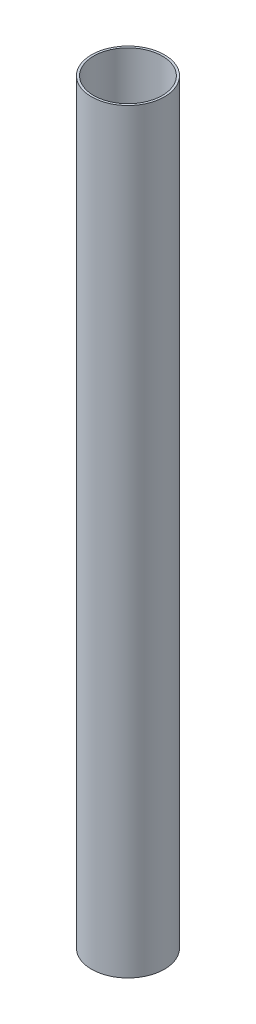
ISO-10303-21;
HEADER;
FILE_DESCRIPTION(('STEP AP214'),'2;1');
FILE_NAME('part.step','',(''),(''),'','','');
FILE_SCHEMA(('AUTOMOTIVE_DESIGN { 1 0 10303 214 1 1 1 1 }'));
ENDSEC;
DATA;
#1=APPLICATION_CONTEXT('core data for automotive mechanical design processes');
#2=APPLICATION_PROTOCOL_DEFINITION('international standard','automotive_design',2000,#1);
#3=PRODUCT_CONTEXT('',#1,'mechanical');
#4=PRODUCT('Part','Part','',(#3));
#5=PRODUCT_RELATED_PRODUCT_CATEGORY('part','',(#4));
#6=PRODUCT_DEFINITION_FORMATION('','',#4);
#7=PRODUCT_DEFINITION_CONTEXT('part definition',#1,'design');
#8=PRODUCT_DEFINITION('design','',#6,#7);
#9=PRODUCT_DEFINITION_SHAPE('','',#8);
#10=(LENGTH_UNIT() NAMED_UNIT(*) SI_UNIT(.MILLI.,.METRE.));
#11=(NAMED_UNIT(*) PLANE_ANGLE_UNIT() SI_UNIT($,.RADIAN.));
#12=(NAMED_UNIT(*) SI_UNIT($,.STERADIAN.) SOLID_ANGLE_UNIT());
#13=UNCERTAINTY_MEASURE_WITH_UNIT(LENGTH_MEASURE(1.E-05),#10,'distance_accuracy_value','');
#14=(GEOMETRIC_REPRESENTATION_CONTEXT(3) GLOBAL_UNCERTAINTY_ASSIGNED_CONTEXT((#13)) GLOBAL_UNIT_ASSIGNED_CONTEXT((#10,
#11,#12)) REPRESENTATION_CONTEXT('',''));
#15=CARTESIAN_POINT('',(0.,0.,0.));
#16=DIRECTION('',(0.,0.,1.));
#17=DIRECTION('',(1.,0.,0.));
#18=AXIS2_PLACEMENT_3D('',#15,#16,#17);
#19=CARTESIAN_POINT('',(0.,1146.81,0.));
#20=DIRECTION('',(0.,1.,0.));
#21=DIRECTION('',(0.,0.,1.));
#22=AXIS2_PLACEMENT_3D('',#19,#20,#21);
#23=CYLINDRICAL_SURFACE('',#22,49.5299999999999);
#24=CARTESIAN_POINT('',(0.,0.,0.));
#25=DIRECTION('',(0.,1.,0.));
#26=DIRECTION('',(0.,0.,1.));
#27=AXIS2_PLACEMENT_3D('',#24,#25,#26);
#28=CIRCLE('',#27,49.53);
#29=CARTESIAN_POINT('',(0.,0.,49.53));
#30=VERTEX_POINT('',#29);
#31=EDGE_CURVE('E10',#30,#30,#28,.T.);
#32=ORIENTED_EDGE('',*,*,#31,.F.);
#33=EDGE_LOOP('',(#32));
#34=FACE_BOUND('',#33,.T.);
#35=CARTESIAN_POINT('',(0.,1092.2,0.));
#36=DIRECTION('',(0.,1.,0.));
#37=DIRECTION('',(0.,0.,1.));
#38=AXIS2_PLACEMENT_3D('',#35,#36,#37);
#39=CIRCLE('',#38,49.5299999999999);
#40=CARTESIAN_POINT('',(0.,1092.2,49.5299999999999));
#41=VERTEX_POINT('',#40);
#42=EDGE_CURVE('E50',#41,#41,#39,.T.);
#43=ORIENTED_EDGE('',*,*,#42,.T.);
#44=EDGE_LOOP('',(#43));
#45=FACE_BOUND('',#44,.T.);
#46=ADVANCED_FACE('F36',(#34,#45),#23,.F.);
#47=CARTESIAN_POINT('',(49.53,0.,0.));
#48=DIRECTION('',(0.,1.,0.));
#49=DIRECTION('',(0.,0.,1.));
#50=AXIS2_PLACEMENT_3D('',#47,#48,#49);
#51=PLANE('',#50);
#52=CARTESIAN_POINT('',(0.,0.,0.));
#53=DIRECTION('',(0.,1.,0.));
#54=DIRECTION('',(0.,0.,1.));
#55=AXIS2_PLACEMENT_3D('',#52,#53,#54);
#56=CIRCLE('',#55,52.705);
#57=CARTESIAN_POINT('',(0.,0.,52.705));
#58=VERTEX_POINT('',#57);
#59=EDGE_CURVE('E42',#58,#58,#56,.T.);
#60=ORIENTED_EDGE('',*,*,#59,.F.);
#61=EDGE_LOOP('',(#60));
#62=FACE_BOUND('',#61,.T.);
#63=ORIENTED_EDGE('',*,*,#31,.T.);
#64=EDGE_LOOP('',(#63));
#65=FACE_BOUND('',#64,.T.);
#66=ADVANCED_FACE('F65',(#62,#65),#51,.F.);
#67=CARTESIAN_POINT('',(0.,1146.81,0.));
#68=DIRECTION('',(0.,1.,0.));
#69=DIRECTION('',(0.,0.,1.));
#70=AXIS2_PLACEMENT_3D('',#67,#68,#69);
#71=CYLINDRICAL_SURFACE('',#70,52.7049999999999);
#72=CARTESIAN_POINT('',(0.,1092.2,0.));
#73=DIRECTION('',(0.,1.,0.));
#74=DIRECTION('',(0.,0.,1.));
#75=AXIS2_PLACEMENT_3D('',#72,#73,#74);
#76=CIRCLE('',#75,52.7049999999999);
#77=CARTESIAN_POINT('',(0.,1092.2,52.7049999999999));
#78=VERTEX_POINT('',#77);
#79=EDGE_CURVE('E46',#78,#78,#76,.T.);
#80=ORIENTED_EDGE('',*,*,#79,.F.);
#81=EDGE_LOOP('',(#80));
#82=FACE_BOUND('',#81,.T.);
#83=ORIENTED_EDGE('',*,*,#59,.T.);
#84=EDGE_LOOP('',(#83));
#85=FACE_BOUND('',#84,.T.);
#86=ADVANCED_FACE('F60',(#82,#85),#71,.T.);
#87=CARTESIAN_POINT('',(49.5299999999999,1092.2,0.));
#88=DIRECTION('',(0.,-1.,0.));
#89=DIRECTION('',(0.,0.,-1.));
#90=AXIS2_PLACEMENT_3D('',#87,#88,#89);
#91=PLANE('',#90);
#92=ORIENTED_EDGE('',*,*,#42,.F.);
#93=EDGE_LOOP('',(#92));
#94=FACE_BOUND('',#93,.T.);
#95=ORIENTED_EDGE('',*,*,#79,.T.);
#96=EDGE_LOOP('',(#95));
#97=FACE_BOUND('',#96,.T.);
#98=ADVANCED_FACE('F57',(#94,#97),#91,.F.);
#99=CLOSED_SHELL('',(#46,#66,#86,#98));
#100=MANIFOLD_SOLID_BREP('B2',#99);
#101=ADVANCED_BREP_SHAPE_REPRESENTATION('',(#18,#100),#14);
#102=SHAPE_DEFINITION_REPRESENTATION(#9,#101);
ENDSEC;
END-ISO-10303-21;
